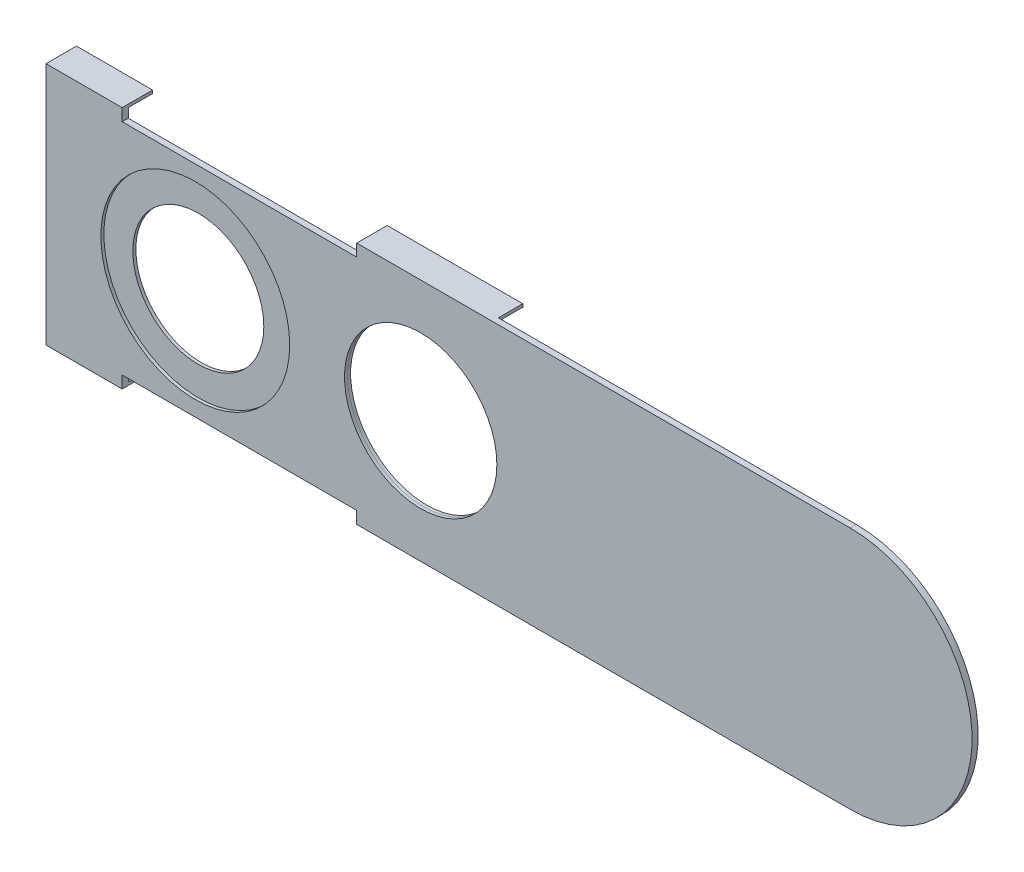
ISO-10303-21;
HEADER;
FILE_DESCRIPTION(('STEP AP214'),'2;1');
FILE_NAME('part.step','',(''),(''),'','','');
FILE_SCHEMA(('AUTOMOTIVE_DESIGN { 1 0 10303 214 1 1 1 1 }'));
ENDSEC;
DATA;
#1=APPLICATION_CONTEXT('core data for automotive mechanical design processes');
#2=APPLICATION_PROTOCOL_DEFINITION('international standard','automotive_design',2000,#1);
#3=PRODUCT_CONTEXT('',#1,'mechanical');
#4=PRODUCT('Part','Part','',(#3));
#5=PRODUCT_RELATED_PRODUCT_CATEGORY('part','',(#4));
#6=PRODUCT_DEFINITION_FORMATION('','',#4);
#7=PRODUCT_DEFINITION_CONTEXT('part definition',#1,'design');
#8=PRODUCT_DEFINITION('design','',#6,#7);
#9=PRODUCT_DEFINITION_SHAPE('','',#8);
#10=(LENGTH_UNIT() NAMED_UNIT(*) SI_UNIT(.MILLI.,.METRE.));
#11=(NAMED_UNIT(*) PLANE_ANGLE_UNIT() SI_UNIT($,.RADIAN.));
#12=(NAMED_UNIT(*) SI_UNIT($,.STERADIAN.) SOLID_ANGLE_UNIT());
#13=UNCERTAINTY_MEASURE_WITH_UNIT(LENGTH_MEASURE(1.E-05),#10,'distance_accuracy_value','');
#14=(GEOMETRIC_REPRESENTATION_CONTEXT(3) GLOBAL_UNCERTAINTY_ASSIGNED_CONTEXT((#13)) GLOBAL_UNIT_ASSIGNED_CONTEXT((#10,
#11,#12)) REPRESENTATION_CONTEXT('',''));
#15=CARTESIAN_POINT('',(0.,0.,0.));
#16=DIRECTION('',(0.,0.,1.));
#17=DIRECTION('',(1.,0.,0.));
#18=AXIS2_PLACEMENT_3D('',#15,#16,#17);
#19=CARTESIAN_POINT('',(0.,0.,0.));
#20=DIRECTION('',(0.,0.,1.));
#21=DIRECTION('',(1.,0.,0.));
#22=AXIS2_PLACEMENT_3D('',#19,#20,#21);
#23=PLANE('',#22);
#24=CARTESIAN_POINT('',(-54.61,0.,0.));
#25=DIRECTION('',(0.,0.,1.));
#26=DIRECTION('',(1.,0.,0.));
#27=AXIS2_PLACEMENT_3D('',#24,#25,#26);
#28=CIRCLE('',#27,5.461);
#29=CARTESIAN_POINT('',(-49.149,0.,0.));
#30=VERTEX_POINT('',#29);
#31=EDGE_CURVE('E341',#30,#30,#28,.T.);
#32=ORIENTED_EDGE('',*,*,#31,.T.);
#33=EDGE_LOOP('',(#32));
#34=FACE_BOUND('',#33,.T.);
#35=CARTESIAN_POINT('',(-35.814,0.,0.));
#36=DIRECTION('',(0.,0.,1.));
#37=DIRECTION('',(1.,0.,0.));
#38=AXIS2_PLACEMENT_3D('',#35,#36,#37);
#39=CIRCLE('',#38,6.3541606169456);
#40=CARTESIAN_POINT('',(-29.4598393830544,0.,0.));
#41=VERTEX_POINT('',#40);
#42=EDGE_CURVE('E347',#41,#41,#39,.T.);
#43=ORIENTED_EDGE('',*,*,#42,.T.);
#44=EDGE_LOOP('',(#43));
#45=FACE_BOUND('',#44,.T.);
#46=DIRECTION('',(1.,0.,0.));
#47=VECTOR('',#46,1.);
#48=CARTESIAN_POINT('',(-41.148,-9.906,0.));
#49=LINE('',#48,#47);
#50=CARTESIAN_POINT('',(-41.148,-9.906,0.));
#51=VERTEX_POINT('',#50);
#52=CARTESIAN_POINT('',(-29.21,-9.906,0.));
#53=VERTEX_POINT('',#52);
#54=EDGE_CURVE('E807',#51,#53,#49,.T.);
#55=ORIENTED_EDGE('',*,*,#54,.F.);
#56=DIRECTION('',(0.,1.,0.));
#57=VECTOR('',#56,1.);
#58=CARTESIAN_POINT('',(-41.1480000000001,-2.81025203108243E-13,0.));
#59=LINE('',#58,#57);
#60=CARTESIAN_POINT('',(-41.148,-9.144,0.));
#61=VERTEX_POINT('',#60);
#62=EDGE_CURVE('E226',#51,#61,#59,.T.);
#63=ORIENTED_EDGE('',*,*,#62,.T.);
#64=DIRECTION('',(1.,0.,0.));
#65=VECTOR('',#64,1.);
#66=CARTESIAN_POINT('',(0.,-9.144,0.));
#67=LINE('',#66,#65);
#68=CARTESIAN_POINT('',(-60.706,-9.144,0.));
#69=VERTEX_POINT('',#68);
#70=EDGE_CURVE('E324',#69,#61,#67,.T.);
#71=ORIENTED_EDGE('',*,*,#70,.F.);
#72=DIRECTION('',(0.,-1.,0.));
#73=VECTOR('',#72,1.);
#74=CARTESIAN_POINT('',(-60.7060000000001,-4.14598910758457E-13,0.));
#75=LINE('',#74,#73);
#76=CARTESIAN_POINT('',(-60.706,-9.906,0.));
#77=VERTEX_POINT('',#76);
#78=EDGE_CURVE('E331',#69,#77,#75,.T.);
#79=ORIENTED_EDGE('',*,*,#78,.T.);
#80=DIRECTION('',(1.,0.,0.));
#81=VECTOR('',#80,1.);
#82=CARTESIAN_POINT('',(-67.056,-9.906,0.));
#83=LINE('',#82,#81);
#84=CARTESIAN_POINT('',(-67.056,-9.906,0.));
#85=VERTEX_POINT('',#84);
#86=EDGE_CURVE('E227',#85,#77,#83,.T.);
#87=ORIENTED_EDGE('',*,*,#86,.F.);
#88=DIRECTION('',(0.,1.,0.));
#89=VECTOR('',#88,1.);
#90=CARTESIAN_POINT('',(-67.056,0.,0.));
#91=LINE('',#90,#89);
#92=CARTESIAN_POINT('',(-67.056,9.906,0.));
#93=VERTEX_POINT('',#92);
#94=EDGE_CURVE('E416',#85,#93,#91,.T.);
#95=ORIENTED_EDGE('',*,*,#94,.T.);
#96=DIRECTION('',(-1.,0.,0.));
#97=VECTOR('',#96,1.);
#98=CARTESIAN_POINT('',(-60.706,9.906,0.));
#99=LINE('',#98,#97);
#100=CARTESIAN_POINT('',(-60.706,9.906,0.));
#101=VERTEX_POINT('',#100);
#102=EDGE_CURVE('E276',#101,#93,#99,.T.);
#103=ORIENTED_EDGE('',*,*,#102,.F.);
#104=DIRECTION('',(0.,-1.,0.));
#105=VECTOR('',#104,1.);
#106=CARTESIAN_POINT('',(-60.706,0.,0.));
#107=LINE('',#106,#105);
#108=CARTESIAN_POINT('',(-60.706,9.144,0.));
#109=VERTEX_POINT('',#108);
#110=EDGE_CURVE('E299',#101,#109,#107,.T.);
#111=ORIENTED_EDGE('',*,*,#110,.T.);
#112=DIRECTION('',(1.,0.,0.));
#113=VECTOR('',#112,1.);
#114=CARTESIAN_POINT('',(0.,9.144,0.));
#115=LINE('',#114,#113);
#116=CARTESIAN_POINT('',(-41.148,9.144,0.));
#117=VERTEX_POINT('',#116);
#118=EDGE_CURVE('E306',#109,#117,#115,.T.);
#119=ORIENTED_EDGE('',*,*,#118,.T.);
#120=DIRECTION('',(0.,1.,0.));
#121=VECTOR('',#120,1.);
#122=CARTESIAN_POINT('',(-41.148,0.,0.));
#123=LINE('',#122,#121);
#124=CARTESIAN_POINT('',(-41.148,9.906,0.));
#125=VERTEX_POINT('',#124);
#126=EDGE_CURVE('E304',#117,#125,#123,.T.);
#127=ORIENTED_EDGE('',*,*,#126,.T.);
#128=DIRECTION('',(-1.,0.,0.));
#129=VECTOR('',#128,1.);
#130=CARTESIAN_POINT('',(-41.148,9.906,0.));
#131=LINE('',#130,#129);
#132=CARTESIAN_POINT('',(-29.8448172325437,9.906,0.));
#133=VERTEX_POINT('',#132);
#134=EDGE_CURVE('E257',#133,#125,#131,.T.);
#135=ORIENTED_EDGE('',*,*,#134,.F.);
#136=DIRECTION('',(0.,-1.,0.));
#137=VECTOR('',#136,1.);
#138=CARTESIAN_POINT('',(-29.8448172325437,10.16,0.));
#139=LINE('',#138,#137);
#140=CARTESIAN_POINT('',(-29.8448172325437,10.16,0.));
#141=VERTEX_POINT('',#140);
#142=EDGE_CURVE('E252',#141,#133,#139,.T.);
#143=ORIENTED_EDGE('',*,*,#142,.F.);
#144=DIRECTION('',(1.,0.,0.));
#145=VECTOR('',#144,1.);
#146=CARTESIAN_POINT('',(0.,10.16,0.));
#147=LINE('',#146,#145);
#148=CARTESIAN_POINT('',(0.,10.16,0.));
#149=VERTEX_POINT('',#148);
#150=EDGE_CURVE('E411',#141,#149,#147,.T.);
#151=ORIENTED_EDGE('',*,*,#150,.T.);
#152=CARTESIAN_POINT('',(0.,0.,0.));
#153=DIRECTION('',(0.,0.,1.));
#154=DIRECTION('',(1.,0.,0.));
#155=AXIS2_PLACEMENT_3D('',#152,#153,#154);
#156=CIRCLE('',#155,10.16);
#157=CARTESIAN_POINT('',(0.,-10.16,0.));
#158=VERTEX_POINT('',#157);
#159=EDGE_CURVE('E417',#158,#149,#156,.T.);
#160=ORIENTED_EDGE('',*,*,#159,.F.);
#161=DIRECTION('',(-1.,0.,0.));
#162=VECTOR('',#161,1.);
#163=CARTESIAN_POINT('',(0.,-10.16,0.));
#164=LINE('',#163,#162);
#165=CARTESIAN_POINT('',(-29.21,-10.16,0.));
#166=VERTEX_POINT('',#165);
#167=EDGE_CURVE('E76',#158,#166,#164,.T.);
#168=ORIENTED_EDGE('',*,*,#167,.T.);
#169=DIRECTION('',(0.,-1.,0.));
#170=VECTOR('',#169,1.);
#171=CARTESIAN_POINT('',(-29.21,-10.16,0.));
#172=LINE('',#171,#170);
#173=EDGE_CURVE('E71',#53,#166,#172,.T.);
#174=ORIENTED_EDGE('',*,*,#173,.F.);
#175=EDGE_LOOP('',(#55,#63,#71,#79,#87,#95,#103,#111,#119,#127,#135,#143,#151,#160,#168,#174));
#176=FACE_BOUND('',#175,.T.);
#177=ADVANCED_FACE('F52',(#34,#45,#176),#23,.F.);
#178=CARTESIAN_POINT('',(0.,10.16,0.508));
#179=DIRECTION('',(0.,1.,0.));
#180=DIRECTION('',(0.,0.,1.));
#181=AXIS2_PLACEMENT_3D('',#178,#179,#180);
#182=PLANE('',#181);
#183=ORIENTED_EDGE('',*,*,#150,.F.);
#184=DIRECTION('',(0.,0.,1.));
#185=VECTOR('',#184,1.);
#186=CARTESIAN_POINT('',(-29.8448172325437,10.16,-2.032));
#187=LINE('',#186,#185);
#188=CARTESIAN_POINT('',(-29.8448172325437,10.16,-2.032));
#189=VERTEX_POINT('',#188);
#190=EDGE_CURVE('E273',#189,#141,#187,.T.);
#191=ORIENTED_EDGE('',*,*,#190,.F.);
#192=DIRECTION('',(1.,0.,0.));
#193=VECTOR('',#192,1.);
#194=CARTESIAN_POINT('',(-41.148,10.16,-2.032));
#195=LINE('',#194,#193);
#196=CARTESIAN_POINT('',(-41.148,10.16,-2.032));
#197=VERTEX_POINT('',#196);
#198=EDGE_CURVE('E256',#197,#189,#195,.T.);
#199=ORIENTED_EDGE('',*,*,#198,.F.);
#200=DIRECTION('',(0.,0.,-1.));
#201=VECTOR('',#200,1.);
#202=CARTESIAN_POINT('',(-41.148,10.16,0.508));
#203=LINE('',#202,#201);
#204=CARTESIAN_POINT('',(-41.148,10.16,0.508));
#205=VERTEX_POINT('',#204);
#206=EDGE_CURVE('E311',#205,#197,#203,.T.);
#207=ORIENTED_EDGE('',*,*,#206,.F.);
#208=DIRECTION('',(1.,0.,0.));
#209=VECTOR('',#208,1.);
#210=CARTESIAN_POINT('',(0.,10.16,0.508));
#211=LINE('',#210,#209);
#212=CARTESIAN_POINT('',(0.,10.16,0.508));
#213=VERTEX_POINT('',#212);
#214=EDGE_CURVE('E429',#205,#213,#211,.T.);
#215=ORIENTED_EDGE('',*,*,#214,.T.);
#216=DIRECTION('',(0.,0.,-1.));
#217=VECTOR('',#216,1.);
#218=CARTESIAN_POINT('',(0.,10.16,0.508));
#219=LINE('',#218,#217);
#220=EDGE_CURVE('E13',#213,#149,#219,.T.);
#221=ORIENTED_EDGE('',*,*,#220,.T.);
#222=EDGE_LOOP('',(#183,#191,#199,#207,#215,#221));
#223=FACE_BOUND('',#222,.T.);
#224=ADVANCED_FACE('F394',(#223),#182,.T.);
#225=CARTESIAN_POINT('',(-67.056,10.16,0.508));
#226=VERTEX_POINT('',#225);
#227=CARTESIAN_POINT('',(-60.706,10.16,0.508));
#228=VERTEX_POINT('',#227);
#229=EDGE_CURVE('E438',#226,#228,#211,.T.);
#230=ORIENTED_EDGE('',*,*,#229,.T.);
#231=DIRECTION('',(0.,0.,-1.));
#232=VECTOR('',#231,1.);
#233=CARTESIAN_POINT('',(-60.706,10.16,0.508));
#234=LINE('',#233,#232);
#235=CARTESIAN_POINT('',(-60.706,10.16,-2.032));
#236=VERTEX_POINT('',#235);
#237=EDGE_CURVE('E314',#228,#236,#234,.T.);
#238=ORIENTED_EDGE('',*,*,#237,.T.);
#239=DIRECTION('',(1.,0.,0.));
#240=VECTOR('',#239,1.);
#241=CARTESIAN_POINT('',(-60.706,10.16,-2.032));
#242=LINE('',#241,#240);
#243=CARTESIAN_POINT('',(-67.056,10.16,-2.032));
#244=VERTEX_POINT('',#243);
#245=EDGE_CURVE('E285',#244,#236,#242,.T.);
#246=ORIENTED_EDGE('',*,*,#245,.F.);
#247=DIRECTION('',(0.,0.,-1.));
#248=VECTOR('',#247,1.);
#249=CARTESIAN_POINT('',(-67.056,10.16,0.508));
#250=LINE('',#249,#248);
#251=EDGE_CURVE('E63',#226,#244,#250,.T.);
#252=ORIENTED_EDGE('',*,*,#251,.F.);
#253=EDGE_LOOP('',(#230,#238,#246,#252));
#254=FACE_BOUND('',#253,.T.);
#255=ADVANCED_FACE('F399',(#254),#182,.T.);
#256=CARTESIAN_POINT('',(0.,-10.16,0.508));
#257=DIRECTION('',(0.,-1.,0.));
#258=DIRECTION('',(0.,0.,-1.));
#259=AXIS2_PLACEMENT_3D('',#256,#257,#258);
#260=PLANE('',#259);
#261=DIRECTION('',(-1.,0.,0.));
#262=VECTOR('',#261,1.);
#263=CARTESIAN_POINT('',(0.,-10.16,0.508));
#264=LINE('',#263,#262);
#265=CARTESIAN_POINT('',(0.,-10.16,0.508));
#266=VERTEX_POINT('',#265);
#267=CARTESIAN_POINT('',(-41.148,-10.16,0.508));
#268=VERTEX_POINT('',#267);
#269=EDGE_CURVE('E448',#266,#268,#264,.T.);
#270=ORIENTED_EDGE('',*,*,#269,.T.);
#271=DIRECTION('',(0.,0.,-1.));
#272=VECTOR('',#271,1.);
#273=CARTESIAN_POINT('',(-41.148,-10.16,0.508));
#274=LINE('',#273,#272);
#275=CARTESIAN_POINT('',(-41.148,-10.16,-2.032));
#276=VERTEX_POINT('',#275);
#277=EDGE_CURVE('E329',#268,#276,#274,.T.);
#278=ORIENTED_EDGE('',*,*,#277,.T.);
#279=DIRECTION('',(-1.,0.,0.));
#280=VECTOR('',#279,1.);
#281=CARTESIAN_POINT('',(-41.148,-10.16,-2.032));
#282=LINE('',#281,#280);
#283=CARTESIAN_POINT('',(-29.21,-10.16,-2.032));
#284=VERTEX_POINT('',#283);
#285=EDGE_CURVE('E221',#284,#276,#282,.T.);
#286=ORIENTED_EDGE('',*,*,#285,.F.);
#287=DIRECTION('',(0.,0.,1.));
#288=VECTOR('',#287,1.);
#289=CARTESIAN_POINT('',(-29.21,-10.16,-2.032));
#290=LINE('',#289,#288);
#291=EDGE_CURVE('E232',#284,#166,#290,.T.);
#292=ORIENTED_EDGE('',*,*,#291,.T.);
#293=ORIENTED_EDGE('',*,*,#167,.F.);
#294=DIRECTION('',(0.,0.,-1.));
#295=VECTOR('',#294,1.);
#296=CARTESIAN_POINT('',(0.,-10.16,0.508));
#297=LINE('',#296,#295);
#298=EDGE_CURVE('E451',#266,#158,#297,.T.);
#299=ORIENTED_EDGE('',*,*,#298,.F.);
#300=EDGE_LOOP('',(#270,#278,#286,#292,#293,#299));
#301=FACE_BOUND('',#300,.T.);
#302=ADVANCED_FACE('F396',(#301),#260,.T.);
#303=DIRECTION('',(0.,0.,-1.));
#304=VECTOR('',#303,1.);
#305=CARTESIAN_POINT('',(-67.056,-10.16,0.508));
#306=LINE('',#305,#304);
#307=CARTESIAN_POINT('',(-67.056,-10.16,0.508));
#308=VERTEX_POINT('',#307);
#309=CARTESIAN_POINT('',(-67.056,-10.16,-2.032));
#310=VERTEX_POINT('',#309);
#311=EDGE_CURVE('E456',#308,#310,#306,.T.);
#312=ORIENTED_EDGE('',*,*,#311,.T.);
#313=DIRECTION('',(-1.,0.,0.));
#314=VECTOR('',#313,1.);
#315=CARTESIAN_POINT('',(-67.056,-10.16,-2.032));
#316=LINE('',#315,#314);
#317=CARTESIAN_POINT('',(-60.706,-10.16,-2.032));
#318=VERTEX_POINT('',#317);
#319=EDGE_CURVE('E243',#318,#310,#316,.T.);
#320=ORIENTED_EDGE('',*,*,#319,.F.);
#321=DIRECTION('',(0.,0.,-1.));
#322=VECTOR('',#321,1.);
#323=CARTESIAN_POINT('',(-60.706,-10.16,0.508));
#324=LINE('',#323,#322);
#325=CARTESIAN_POINT('',(-60.706,-10.16,0.508));
#326=VERTEX_POINT('',#325);
#327=EDGE_CURVE('E338',#326,#318,#324,.T.);
#328=ORIENTED_EDGE('',*,*,#327,.F.);
#329=EDGE_CURVE('E447',#326,#308,#264,.T.);
#330=ORIENTED_EDGE('',*,*,#329,.T.);
#331=EDGE_LOOP('',(#312,#320,#328,#330));
#332=FACE_BOUND('',#331,.T.);
#333=ADVANCED_FACE('F390',(#332),#260,.T.);
#334=CARTESIAN_POINT('',(0.,0.,0.508));
#335=DIRECTION('',(0.,0.,1.));
#336=DIRECTION('',(1.,0.,0.));
#337=AXIS2_PLACEMENT_3D('',#334,#335,#336);
#338=PLANE('',#337);
#339=CARTESIAN_POINT('',(-54.61,0.,0.508));
#340=DIRECTION('',(0.,0.,1.));
#341=DIRECTION('',(1.,0.,0.));
#342=AXIS2_PLACEMENT_3D('',#339,#340,#341);
#343=CIRCLE('',#342,7.874);
#344=CARTESIAN_POINT('',(-46.736,0.,0.508));
#345=VERTEX_POINT('',#344);
#346=EDGE_CURVE('E462',#345,#345,#343,.T.);
#347=ORIENTED_EDGE('',*,*,#346,.F.);
#348=EDGE_LOOP('',(#347));
#349=FACE_BOUND('',#348,.T.);
#350=CARTESIAN_POINT('',(-35.814,0.,0.508));
#351=DIRECTION('',(0.,0.,1.));
#352=DIRECTION('',(1.,0.,0.));
#353=AXIS2_PLACEMENT_3D('',#350,#351,#352);
#354=CIRCLE('',#353,6.35);
#355=CARTESIAN_POINT('',(-29.464,0.,0.508));
#356=VERTEX_POINT('',#355);
#357=EDGE_CURVE('E350',#356,#356,#354,.T.);
#358=ORIENTED_EDGE('',*,*,#357,.F.);
#359=EDGE_LOOP('',(#358));
#360=FACE_BOUND('',#359,.T.);
#361=ORIENTED_EDGE('',*,*,#214,.F.);
#362=DIRECTION('',(0.,1.,0.));
#363=VECTOR('',#362,1.);
#364=CARTESIAN_POINT('',(-41.148,0.,0.508));
#365=LINE('',#364,#363);
#366=CARTESIAN_POINT('',(-41.148,9.144,0.508));
#367=VERTEX_POINT('',#366);
#368=EDGE_CURVE('E296',#367,#205,#365,.T.);
#369=ORIENTED_EDGE('',*,*,#368,.F.);
#370=DIRECTION('',(1.,0.,0.));
#371=VECTOR('',#370,1.);
#372=CARTESIAN_POINT('',(0.,9.144,0.508));
#373=LINE('',#372,#371);
#374=CARTESIAN_POINT('',(-60.706,9.144,0.508));
#375=VERTEX_POINT('',#374);
#376=EDGE_CURVE('E298',#375,#367,#373,.T.);
#377=ORIENTED_EDGE('',*,*,#376,.F.);
#378=DIRECTION('',(0.,-1.,0.));
#379=VECTOR('',#378,1.);
#380=CARTESIAN_POINT('',(-60.706,0.,0.508));
#381=LINE('',#380,#379);
#382=EDGE_CURVE('E301',#228,#375,#381,.T.);
#383=ORIENTED_EDGE('',*,*,#382,.F.);
#384=ORIENTED_EDGE('',*,*,#229,.F.);
#385=DIRECTION('',(0.,1.,0.));
#386=VECTOR('',#385,1.);
#387=CARTESIAN_POINT('',(-67.056,0.,0.508));
#388=LINE('',#387,#386);
#389=EDGE_CURVE('E441',#308,#226,#388,.T.);
#390=ORIENTED_EDGE('',*,*,#389,.F.);
#391=ORIENTED_EDGE('',*,*,#329,.F.);
#392=DIRECTION('',(0.,-1.,0.));
#393=VECTOR('',#392,1.);
#394=CARTESIAN_POINT('',(-60.7060000000001,-4.14598910758457E-13,0.508));
#395=LINE('',#394,#393);
#396=CARTESIAN_POINT('',(-60.706,-9.144,0.508));
#397=VERTEX_POINT('',#396);
#398=EDGE_CURVE('E323',#397,#326,#395,.T.);
#399=ORIENTED_EDGE('',*,*,#398,.F.);
#400=DIRECTION('',(1.,0.,0.));
#401=VECTOR('',#400,1.);
#402=CARTESIAN_POINT('',(0.,-9.144,0.508));
#403=LINE('',#402,#401);
#404=CARTESIAN_POINT('',(-41.148,-9.144,0.508));
#405=VERTEX_POINT('',#404);
#406=EDGE_CURVE('E326',#397,#405,#403,.T.);
#407=ORIENTED_EDGE('',*,*,#406,.T.);
#408=DIRECTION('',(0.,1.,0.));
#409=VECTOR('',#408,1.);
#410=CARTESIAN_POINT('',(-41.1480000000001,-2.81025203108243E-13,0.508));
#411=LINE('',#410,#409);
#412=EDGE_CURVE('E321',#268,#405,#411,.T.);
#413=ORIENTED_EDGE('',*,*,#412,.F.);
#414=ORIENTED_EDGE('',*,*,#269,.F.);
#415=CARTESIAN_POINT('',(0.,0.,0.508));
#416=DIRECTION('',(0.,0.,1.));
#417=DIRECTION('',(1.,0.,0.));
#418=AXIS2_PLACEMENT_3D('',#415,#416,#417);
#419=CIRCLE('',#418,10.16);
#420=EDGE_CURVE('E437',#266,#213,#419,.T.);
#421=ORIENTED_EDGE('',*,*,#420,.T.);
#422=EDGE_LOOP('',(#361,#369,#377,#383,#384,#390,#391,#399,#407,#413,#414,#421));
#423=FACE_BOUND('',#422,.T.);
#424=ADVANCED_FACE('F387',(#349,#360,#423),#338,.T.);
#425=CARTESIAN_POINT('',(0.,0.,0.508));
#426=DIRECTION('',(0.,0.,-1.));
#427=DIRECTION('',(-1.,0.,0.));
#428=AXIS2_PLACEMENT_3D('',#425,#426,#427);
#429=CYLINDRICAL_SURFACE('',#428,10.16);
#430=ORIENTED_EDGE('',*,*,#159,.T.);
#431=ORIENTED_EDGE('',*,*,#220,.F.);
#432=ORIENTED_EDGE('',*,*,#420,.F.);
#433=ORIENTED_EDGE('',*,*,#298,.T.);
#434=EDGE_LOOP('',(#430,#431,#432,#433));
#435=FACE_BOUND('',#434,.T.);
#436=ADVANCED_FACE('F54',(#435),#429,.T.);
#437=CARTESIAN_POINT('',(-67.056,0.,0.508));
#438=DIRECTION('',(-1.,0.,0.));
#439=DIRECTION('',(0.,0.,1.));
#440=AXIS2_PLACEMENT_3D('',#437,#438,#439);
#441=PLANE('',#440);
#442=ORIENTED_EDGE('',*,*,#94,.F.);
#443=DIRECTION('',(0.,0.,1.));
#444=VECTOR('',#443,1.);
#445=CARTESIAN_POINT('',(-67.056,-9.906,-2.032));
#446=LINE('',#445,#444);
#447=CARTESIAN_POINT('',(-67.056,-9.906,-2.032));
#448=VERTEX_POINT('',#447);
#449=EDGE_CURVE('E249',#448,#85,#446,.T.);
#450=ORIENTED_EDGE('',*,*,#449,.F.);
#451=DIRECTION('',(0.,1.,0.));
#452=VECTOR('',#451,1.);
#453=CARTESIAN_POINT('',(-67.056,-10.16,-2.032));
#454=LINE('',#453,#452);
#455=EDGE_CURVE('E230',#310,#448,#454,.T.);
#456=ORIENTED_EDGE('',*,*,#455,.F.);
#457=ORIENTED_EDGE('',*,*,#311,.F.);
#458=ORIENTED_EDGE('',*,*,#389,.T.);
#459=ORIENTED_EDGE('',*,*,#251,.T.);
#460=DIRECTION('',(0.,1.,0.));
#461=VECTOR('',#460,1.);
#462=CARTESIAN_POINT('',(-67.056,10.16,-2.032));
#463=LINE('',#462,#461);
#464=CARTESIAN_POINT('',(-67.056,9.906,-2.032));
#465=VERTEX_POINT('',#464);
#466=EDGE_CURVE('E282',#465,#244,#463,.T.);
#467=ORIENTED_EDGE('',*,*,#466,.F.);
#468=DIRECTION('',(0.,0.,1.));
#469=VECTOR('',#468,1.);
#470=CARTESIAN_POINT('',(-67.056,9.906,-2.032));
#471=LINE('',#470,#469);
#472=EDGE_CURVE('E288',#465,#93,#471,.T.);
#473=ORIENTED_EDGE('',*,*,#472,.T.);
#474=EDGE_LOOP('',(#442,#450,#456,#457,#458,#459,#467,#473));
#475=FACE_BOUND('',#474,.T.);
#476=ADVANCED_FACE('F385',(#475),#441,.T.);
#477=CARTESIAN_POINT('',(-35.814,0.,0.254));
#478=DIRECTION('',(0.,0.,1.));
#479=DIRECTION('',(1.,0.,0.));
#480=AXIS2_PLACEMENT_3D('',#477,#478,#479);
#481=CYLINDRICAL_SURFACE('',#480,6.35);
#482=CARTESIAN_POINT('',(-35.814,0.,0.254));
#483=DIRECTION('',(0.,0.,1.));
#484=DIRECTION('',(1.,0.,0.));
#485=AXIS2_PLACEMENT_3D('',#482,#483,#484);
#486=CIRCLE('',#485,6.3541606169456);
#487=CARTESIAN_POINT('',(-29.4598393830544,0.,0.254));
#488=VERTEX_POINT('',#487);
#489=EDGE_CURVE('E344',#488,#488,#486,.T.);
#490=ORIENTED_EDGE('',*,*,#489,.F.);
#491=EDGE_LOOP('',(#490));
#492=FACE_BOUND('',#491,.T.);
#493=ORIENTED_EDGE('',*,*,#357,.T.);
#494=EDGE_LOOP('',(#493));
#495=FACE_BOUND('',#494,.T.);
#496=ADVANCED_FACE('F380',(#492,#495),#481,.F.);
#497=CARTESIAN_POINT('',(-54.61,0.,0.254));
#498=DIRECTION('',(0.,0.,1.));
#499=DIRECTION('',(1.,0.,0.));
#500=AXIS2_PLACEMENT_3D('',#497,#498,#499);
#501=CYLINDRICAL_SURFACE('',#500,7.874);
#502=CARTESIAN_POINT('',(-54.61,0.,0.254));
#503=DIRECTION('',(0.,0.,1.));
#504=DIRECTION('',(1.,0.,0.));
#505=AXIS2_PLACEMENT_3D('',#502,#503,#504);
#506=CIRCLE('',#505,7.874);
#507=CARTESIAN_POINT('',(-46.736,0.,0.254));
#508=VERTEX_POINT('',#507);
#509=EDGE_CURVE('E359',#508,#508,#506,.T.);
#510=ORIENTED_EDGE('',*,*,#509,.F.);
#511=EDGE_LOOP('',(#510));
#512=FACE_BOUND('',#511,.T.);
#513=ORIENTED_EDGE('',*,*,#346,.T.);
#514=EDGE_LOOP('',(#513));
#515=FACE_BOUND('',#514,.T.);
#516=ADVANCED_FACE('F377',(#512,#515),#501,.F.);
#517=CARTESIAN_POINT('',(-54.61,0.,0.254));
#518=DIRECTION('',(0.,0.,1.));
#519=DIRECTION('',(1.,0.,0.));
#520=AXIS2_PLACEMENT_3D('',#517,#518,#519);
#521=PLANE('',#520);
#522=CARTESIAN_POINT('',(-54.61,0.,0.254));
#523=DIRECTION('',(0.,0.,1.));
#524=DIRECTION('',(1.,0.,0.));
#525=AXIS2_PLACEMENT_3D('',#522,#523,#524);
#526=CIRCLE('',#525,5.461);
#527=CARTESIAN_POINT('',(-49.149,0.,0.254));
#528=VERTEX_POINT('',#527);
#529=EDGE_CURVE('E313',#528,#528,#526,.T.);
#530=ORIENTED_EDGE('',*,*,#529,.F.);
#531=EDGE_LOOP('',(#530));
#532=FACE_BOUND('',#531,.T.);
#533=ORIENTED_EDGE('',*,*,#509,.T.);
#534=EDGE_LOOP('',(#533));
#535=FACE_BOUND('',#534,.T.);
#536=ADVANCED_FACE('F372',(#532,#535),#521,.T.);
#537=CARTESIAN_POINT('',(-35.814,0.,0.));
#538=DIRECTION('',(0.,0.,1.));
#539=DIRECTION('',(1.,0.,0.));
#540=AXIS2_PLACEMENT_3D('',#537,#538,#539);
#541=CYLINDRICAL_SURFACE('',#540,6.3541606169456);
#542=ORIENTED_EDGE('',*,*,#42,.F.);
#543=EDGE_LOOP('',(#542));
#544=FACE_BOUND('',#543,.T.);
#545=ORIENTED_EDGE('',*,*,#489,.T.);
#546=EDGE_LOOP('',(#545));
#547=FACE_BOUND('',#546,.T.);
#548=ADVANCED_FACE('F361',(#544,#547),#541,.F.);
#549=CARTESIAN_POINT('',(-54.61,0.,0.));
#550=DIRECTION('',(0.,0.,1.));
#551=DIRECTION('',(1.,0.,0.));
#552=AXIS2_PLACEMENT_3D('',#549,#550,#551);
#553=CYLINDRICAL_SURFACE('',#552,5.461);
#554=ORIENTED_EDGE('',*,*,#31,.F.);
#555=EDGE_LOOP('',(#554));
#556=FACE_BOUND('',#555,.T.);
#557=ORIENTED_EDGE('',*,*,#529,.T.);
#558=EDGE_LOOP('',(#557));
#559=FACE_BOUND('',#558,.T.);
#560=ADVANCED_FACE('F371',(#556,#559),#553,.F.);
#561=CARTESIAN_POINT('',(-41.1480000000001,-2.81025203108243E-13,0.508));
#562=DIRECTION('',(-1.,0.,0.));
#563=DIRECTION('',(0.,-1.,0.));
#564=AXIS2_PLACEMENT_3D('',#561,#562,#563);
#565=PLANE('',#564);
#566=ORIENTED_EDGE('',*,*,#62,.F.);
#567=DIRECTION('',(0.,0.,1.));
#568=VECTOR('',#567,1.);
#569=CARTESIAN_POINT('',(-41.148,-9.906,-2.032));
#570=LINE('',#569,#568);
#571=CARTESIAN_POINT('',(-41.148,-9.906,-2.032));
#572=VERTEX_POINT('',#571);
#573=EDGE_CURVE('E209',#572,#51,#570,.T.);
#574=ORIENTED_EDGE('',*,*,#573,.F.);
#575=DIRECTION('',(0.,1.,0.));
#576=VECTOR('',#575,1.);
#577=CARTESIAN_POINT('',(-41.148,-10.16,-2.032));
#578=LINE('',#577,#576);
#579=EDGE_CURVE('E215',#276,#572,#578,.T.);
#580=ORIENTED_EDGE('',*,*,#579,.F.);
#581=ORIENTED_EDGE('',*,*,#277,.F.);
#582=ORIENTED_EDGE('',*,*,#412,.T.);
#583=DIRECTION('',(0.,0.,-1.));
#584=VECTOR('',#583,1.);
#585=CARTESIAN_POINT('',(-41.148,-9.144,0.508));
#586=LINE('',#585,#584);
#587=EDGE_CURVE('E307',#405,#61,#586,.T.);
#588=ORIENTED_EDGE('',*,*,#587,.T.);
#589=EDGE_LOOP('',(#566,#574,#580,#581,#582,#588));
#590=FACE_BOUND('',#589,.T.);
#591=ADVANCED_FACE('F224',(#590),#565,.T.);
#592=CARTESIAN_POINT('',(0.,-9.144,0.508));
#593=DIRECTION('',(0.,1.,0.));
#594=DIRECTION('',(-1.,0.,0.));
#595=AXIS2_PLACEMENT_3D('',#592,#593,#594);
#596=PLANE('',#595);
#597=ORIENTED_EDGE('',*,*,#70,.T.);
#598=ORIENTED_EDGE('',*,*,#587,.F.);
#599=ORIENTED_EDGE('',*,*,#406,.F.);
#600=DIRECTION('',(0.,0.,-1.));
#601=VECTOR('',#600,1.);
#602=CARTESIAN_POINT('',(-60.706,-9.144,0.508));
#603=LINE('',#602,#601);
#604=EDGE_CURVE('E336',#397,#69,#603,.T.);
#605=ORIENTED_EDGE('',*,*,#604,.T.);
#606=EDGE_LOOP('',(#597,#598,#599,#605));
#607=FACE_BOUND('',#606,.T.);
#608=ADVANCED_FACE('F516',(#607),#596,.F.);
#609=CARTESIAN_POINT('',(-60.7060000000001,-4.14598910758457E-13,0.508));
#610=DIRECTION('',(1.,0.,0.));
#611=DIRECTION('',(0.,1.,0.));
#612=AXIS2_PLACEMENT_3D('',#609,#610,#611);
#613=PLANE('',#612);
#614=ORIENTED_EDGE('',*,*,#78,.F.);
#615=ORIENTED_EDGE('',*,*,#604,.F.);
#616=ORIENTED_EDGE('',*,*,#398,.T.);
#617=ORIENTED_EDGE('',*,*,#327,.T.);
#618=DIRECTION('',(0.,-1.,0.));
#619=VECTOR('',#618,1.);
#620=CARTESIAN_POINT('',(-60.706,-10.16,-2.032));
#621=LINE('',#620,#619);
#622=CARTESIAN_POINT('',(-60.706,-9.906,-2.032));
#623=VERTEX_POINT('',#622);
#624=EDGE_CURVE('E240',#623,#318,#621,.T.);
#625=ORIENTED_EDGE('',*,*,#624,.F.);
#626=DIRECTION('',(0.,0.,1.));
#627=VECTOR('',#626,1.);
#628=CARTESIAN_POINT('',(-60.706,-9.906,-2.032));
#629=LINE('',#628,#627);
#630=EDGE_CURVE('E245',#623,#77,#629,.T.);
#631=ORIENTED_EDGE('',*,*,#630,.T.);
#632=EDGE_LOOP('',(#614,#615,#616,#617,#625,#631));
#633=FACE_BOUND('',#632,.T.);
#634=ADVANCED_FACE('F515',(#633),#613,.T.);
#635=CARTESIAN_POINT('',(-41.148,0.,0.508));
#636=DIRECTION('',(-1.,0.,0.));
#637=DIRECTION('',(0.,0.,1.));
#638=AXIS2_PLACEMENT_3D('',#635,#636,#637);
#639=PLANE('',#638);
#640=ORIENTED_EDGE('',*,*,#126,.F.);
#641=DIRECTION('',(0.,0.,-1.));
#642=VECTOR('',#641,1.);
#643=CARTESIAN_POINT('',(-41.148,9.144,0.508));
#644=LINE('',#643,#642);
#645=EDGE_CURVE('E303',#367,#117,#644,.T.);
#646=ORIENTED_EDGE('',*,*,#645,.F.);
#647=ORIENTED_EDGE('',*,*,#368,.T.);
#648=ORIENTED_EDGE('',*,*,#206,.T.);
#649=DIRECTION('',(0.,1.,0.));
#650=VECTOR('',#649,1.);
#651=CARTESIAN_POINT('',(-41.148,10.16,-2.032));
#652=LINE('',#651,#650);
#653=CARTESIAN_POINT('',(-41.148,9.906,-2.032));
#654=VERTEX_POINT('',#653);
#655=EDGE_CURVE('E253',#654,#197,#652,.T.);
#656=ORIENTED_EDGE('',*,*,#655,.F.);
#657=DIRECTION('',(0.,0.,1.));
#658=VECTOR('',#657,1.);
#659=CARTESIAN_POINT('',(-41.148,9.906,-2.032));
#660=LINE('',#659,#658);
#661=EDGE_CURVE('E263',#654,#125,#660,.T.);
#662=ORIENTED_EDGE('',*,*,#661,.T.);
#663=EDGE_LOOP('',(#640,#646,#647,#648,#656,#662));
#664=FACE_BOUND('',#663,.T.);
#665=ADVANCED_FACE('F489',(#664),#639,.T.);
#666=CARTESIAN_POINT('',(-60.706,0.,0.508));
#667=DIRECTION('',(1.,0.,0.));
#668=DIRECTION('',(0.,0.,-1.));
#669=AXIS2_PLACEMENT_3D('',#666,#667,#668);
#670=PLANE('',#669);
#671=ORIENTED_EDGE('',*,*,#110,.F.);
#672=DIRECTION('',(0.,0.,1.));
#673=VECTOR('',#672,1.);
#674=CARTESIAN_POINT('',(-60.706,9.906,-2.032));
#675=LINE('',#674,#673);
#676=CARTESIAN_POINT('',(-60.706,9.906,-2.032));
#677=VERTEX_POINT('',#676);
#678=EDGE_CURVE('E293',#677,#101,#675,.T.);
#679=ORIENTED_EDGE('',*,*,#678,.F.);
#680=DIRECTION('',(0.,-1.,0.));
#681=VECTOR('',#680,1.);
#682=CARTESIAN_POINT('',(-60.706,10.16,-2.032));
#683=LINE('',#682,#681);
#684=EDGE_CURVE('E277',#236,#677,#683,.T.);
#685=ORIENTED_EDGE('',*,*,#684,.F.);
#686=ORIENTED_EDGE('',*,*,#237,.F.);
#687=ORIENTED_EDGE('',*,*,#382,.T.);
#688=DIRECTION('',(0.,0.,-1.));
#689=VECTOR('',#688,1.);
#690=CARTESIAN_POINT('',(-60.706,9.144,0.508));
#691=LINE('',#690,#689);
#692=EDGE_CURVE('E316',#375,#109,#691,.T.);
#693=ORIENTED_EDGE('',*,*,#692,.T.);
#694=EDGE_LOOP('',(#671,#679,#685,#686,#687,#693));
#695=FACE_BOUND('',#694,.T.);
#696=ADVANCED_FACE('F482',(#695),#670,.T.);
#697=CARTESIAN_POINT('',(0.,9.144,0.508));
#698=DIRECTION('',(0.,1.,0.));
#699=DIRECTION('',(0.,0.,1.));
#700=AXIS2_PLACEMENT_3D('',#697,#698,#699);
#701=PLANE('',#700);
#702=ORIENTED_EDGE('',*,*,#118,.F.);
#703=ORIENTED_EDGE('',*,*,#692,.F.);
#704=ORIENTED_EDGE('',*,*,#376,.T.);
#705=ORIENTED_EDGE('',*,*,#645,.T.);
#706=EDGE_LOOP('',(#702,#703,#704,#705));
#707=FACE_BOUND('',#706,.T.);
#708=ADVANCED_FACE('F488',(#707),#701,.T.);
#709=CARTESIAN_POINT('',(-60.706,9.906,-2.032));
#710=DIRECTION('',(0.,1.,0.));
#711=DIRECTION('',(0.,0.,1.));
#712=AXIS2_PLACEMENT_3D('',#709,#710,#711);
#713=PLANE('',#712);
#714=ORIENTED_EDGE('',*,*,#102,.T.);
#715=ORIENTED_EDGE('',*,*,#472,.F.);
#716=DIRECTION('',(-1.,0.,0.));
#717=VECTOR('',#716,1.);
#718=CARTESIAN_POINT('',(-60.706,9.906,-2.032));
#719=LINE('',#718,#717);
#720=EDGE_CURVE('E280',#677,#465,#719,.T.);
#721=ORIENTED_EDGE('',*,*,#720,.F.);
#722=ORIENTED_EDGE('',*,*,#678,.T.);
#723=EDGE_LOOP('',(#714,#715,#721,#722));
#724=FACE_BOUND('',#723,.T.);
#725=ADVANCED_FACE('F505',(#724),#713,.F.);
#726=CARTESIAN_POINT('',(0.,0.,-2.032));
#727=DIRECTION('',(0.,0.,-1.));
#728=DIRECTION('',(-1.,0.,0.));
#729=AXIS2_PLACEMENT_3D('',#726,#727,#728);
#730=PLANE('',#729);
#731=ORIENTED_EDGE('',*,*,#684,.T.);
#732=ORIENTED_EDGE('',*,*,#720,.T.);
#733=ORIENTED_EDGE('',*,*,#466,.T.);
#734=ORIENTED_EDGE('',*,*,#245,.T.);
#735=EDGE_LOOP('',(#731,#732,#733,#734));
#736=FACE_BOUND('',#735,.T.);
#737=ADVANCED_FACE('F476',(#736),#730,.T.);
#738=CARTESIAN_POINT('',(-29.8448172325437,10.16,-2.032));
#739=DIRECTION('',(-1.,0.,0.));
#740=DIRECTION('',(0.,0.,1.));
#741=AXIS2_PLACEMENT_3D('',#738,#739,#740);
#742=PLANE('',#741);
#743=ORIENTED_EDGE('',*,*,#142,.T.);
#744=DIRECTION('',(0.,0.,1.));
#745=VECTOR('',#744,1.);
#746=CARTESIAN_POINT('',(-29.8448172325437,9.906,-2.032));
#747=LINE('',#746,#745);
#748=CARTESIAN_POINT('',(-29.8448172325437,9.906,-2.032));
#749=VERTEX_POINT('',#748);
#750=EDGE_CURVE('E270',#749,#133,#747,.T.);
#751=ORIENTED_EDGE('',*,*,#750,.F.);
#752=DIRECTION('',(0.,-1.,0.));
#753=VECTOR('',#752,1.);
#754=CARTESIAN_POINT('',(-29.8448172325437,10.16,-2.032));
#755=LINE('',#754,#753);
#756=EDGE_CURVE('E259',#189,#749,#755,.T.);
#757=ORIENTED_EDGE('',*,*,#756,.F.);
#758=ORIENTED_EDGE('',*,*,#190,.T.);
#759=EDGE_LOOP('',(#743,#751,#757,#758));
#760=FACE_BOUND('',#759,.T.);
#761=ADVANCED_FACE('F420',(#760),#742,.F.);
#762=CARTESIAN_POINT('',(-41.148,9.906,-2.032));
#763=DIRECTION('',(0.,1.,0.));
#764=DIRECTION('',(-1.,0.,0.));
#765=AXIS2_PLACEMENT_3D('',#762,#763,#764);
#766=PLANE('',#765);
#767=ORIENTED_EDGE('',*,*,#134,.T.);
#768=ORIENTED_EDGE('',*,*,#661,.F.);
#769=DIRECTION('',(-1.,0.,0.));
#770=VECTOR('',#769,1.);
#771=CARTESIAN_POINT('',(-41.148,9.906,-2.032));
#772=LINE('',#771,#770);
#773=EDGE_CURVE('E261',#749,#654,#772,.T.);
#774=ORIENTED_EDGE('',*,*,#773,.F.);
#775=ORIENTED_EDGE('',*,*,#750,.T.);
#776=EDGE_LOOP('',(#767,#768,#774,#775));
#777=FACE_BOUND('',#776,.T.);
#778=ADVANCED_FACE('F491',(#777),#766,.F.);
#779=CARTESIAN_POINT('',(0.,0.,-2.032));
#780=DIRECTION('',(0.,0.,1.));
#781=DIRECTION('',(1.,0.,0.));
#782=AXIS2_PLACEMENT_3D('',#779,#780,#781);
#783=PLANE('',#782);
#784=ORIENTED_EDGE('',*,*,#655,.T.);
#785=ORIENTED_EDGE('',*,*,#198,.T.);
#786=ORIENTED_EDGE('',*,*,#756,.T.);
#787=ORIENTED_EDGE('',*,*,#773,.T.);
#788=EDGE_LOOP('',(#784,#785,#786,#787));
#789=FACE_BOUND('',#788,.T.);
#790=ADVANCED_FACE('F424',(#789),#783,.F.);
#791=CARTESIAN_POINT('',(-67.056,-9.906,-2.032));
#792=DIRECTION('',(0.,-1.,0.));
#793=DIRECTION('',(0.,0.,-1.));
#794=AXIS2_PLACEMENT_3D('',#791,#792,#793);
#795=PLANE('',#794);
#796=ORIENTED_EDGE('',*,*,#86,.T.);
#797=ORIENTED_EDGE('',*,*,#630,.F.);
#798=DIRECTION('',(1.,0.,0.));
#799=VECTOR('',#798,1.);
#800=CARTESIAN_POINT('',(-67.056,-9.906,-2.032));
#801=LINE('',#800,#799);
#802=EDGE_CURVE('E238',#448,#623,#801,.T.);
#803=ORIENTED_EDGE('',*,*,#802,.F.);
#804=ORIENTED_EDGE('',*,*,#449,.T.);
#805=EDGE_LOOP('',(#796,#797,#803,#804));
#806=FACE_BOUND('',#805,.T.);
#807=ADVANCED_FACE('F498',(#806),#795,.F.);
#808=CARTESIAN_POINT('',(0.,0.,-2.032));
#809=DIRECTION('',(0.,0.,-1.));
#810=DIRECTION('',(-1.,0.,0.));
#811=AXIS2_PLACEMENT_3D('',#808,#809,#810);
#812=PLANE('',#811);
#813=ORIENTED_EDGE('',*,*,#455,.T.);
#814=ORIENTED_EDGE('',*,*,#802,.T.);
#815=ORIENTED_EDGE('',*,*,#624,.T.);
#816=ORIENTED_EDGE('',*,*,#319,.T.);
#817=EDGE_LOOP('',(#813,#814,#815,#816));
#818=FACE_BOUND('',#817,.T.);
#819=ADVANCED_FACE('F646',(#818),#812,.T.);
#820=CARTESIAN_POINT('',(-41.148,-9.906,-2.032));
#821=DIRECTION('',(0.,-1.,0.));
#822=DIRECTION('',(1.,0.,0.));
#823=AXIS2_PLACEMENT_3D('',#820,#821,#822);
#824=PLANE('',#823);
#825=ORIENTED_EDGE('',*,*,#54,.T.);
#826=DIRECTION('',(0.,0.,1.));
#827=VECTOR('',#826,1.);
#828=CARTESIAN_POINT('',(-29.21,-9.906,-2.032));
#829=LINE('',#828,#827);
#830=CARTESIAN_POINT('',(-29.21,-9.906,-2.032));
#831=VERTEX_POINT('',#830);
#832=EDGE_CURVE('E211',#831,#53,#829,.T.);
#833=ORIENTED_EDGE('',*,*,#832,.F.);
#834=DIRECTION('',(1.,0.,0.));
#835=VECTOR('',#834,1.);
#836=CARTESIAN_POINT('',(-41.148,-9.906,-2.032));
#837=LINE('',#836,#835);
#838=EDGE_CURVE('E205',#572,#831,#837,.T.);
#839=ORIENTED_EDGE('',*,*,#838,.F.);
#840=ORIENTED_EDGE('',*,*,#573,.T.);
#841=EDGE_LOOP('',(#825,#833,#839,#840));
#842=FACE_BOUND('',#841,.T.);
#843=ADVANCED_FACE('F207',(#842),#824,.F.);
#844=CARTESIAN_POINT('',(-29.21,-10.16,-2.032));
#845=DIRECTION('',(-1.,0.,0.));
#846=DIRECTION('',(0.,0.,1.));
#847=AXIS2_PLACEMENT_3D('',#844,#845,#846);
#848=PLANE('',#847);
#849=ORIENTED_EDGE('',*,*,#173,.T.);
#850=ORIENTED_EDGE('',*,*,#291,.F.);
#851=DIRECTION('',(0.,-1.,0.));
#852=VECTOR('',#851,1.);
#853=CARTESIAN_POINT('',(-29.21,-10.16,-2.032));
#854=LINE('',#853,#852);
#855=EDGE_CURVE('E214',#831,#284,#854,.T.);
#856=ORIENTED_EDGE('',*,*,#855,.F.);
#857=ORIENTED_EDGE('',*,*,#832,.T.);
#858=EDGE_LOOP('',(#849,#850,#856,#857));
#859=FACE_BOUND('',#858,.T.);
#860=ADVANCED_FACE('F660',(#859),#848,.F.);
#861=CARTESIAN_POINT('',(0.,0.,-2.032));
#862=DIRECTION('',(0.,0.,-1.));
#863=DIRECTION('',(-1.,0.,0.));
#864=AXIS2_PLACEMENT_3D('',#861,#862,#863);
#865=PLANE('',#864);
#866=ORIENTED_EDGE('',*,*,#579,.T.);
#867=ORIENTED_EDGE('',*,*,#838,.T.);
#868=ORIENTED_EDGE('',*,*,#855,.T.);
#869=ORIENTED_EDGE('',*,*,#285,.T.);
#870=EDGE_LOOP('',(#866,#867,#868,#869));
#871=FACE_BOUND('',#870,.T.);
#872=ADVANCED_FACE('F219',(#871),#865,.T.);
#873=CLOSED_SHELL('',(#177,#224,#255,#302,#333,#424,#436,#476,#496,#516,#536,#548,#560,#591,
#608,#634,#665,#696,#708,#725,#737,#761,#778,#790,#807,#819,#843,#860,#872));
#874=MANIFOLD_SOLID_BREP('B2',#873);
#875=ADVANCED_BREP_SHAPE_REPRESENTATION('',(#18,#874),#14);
#876=SHAPE_DEFINITION_REPRESENTATION(#9,#875);
ENDSEC;
END-ISO-10303-21;
